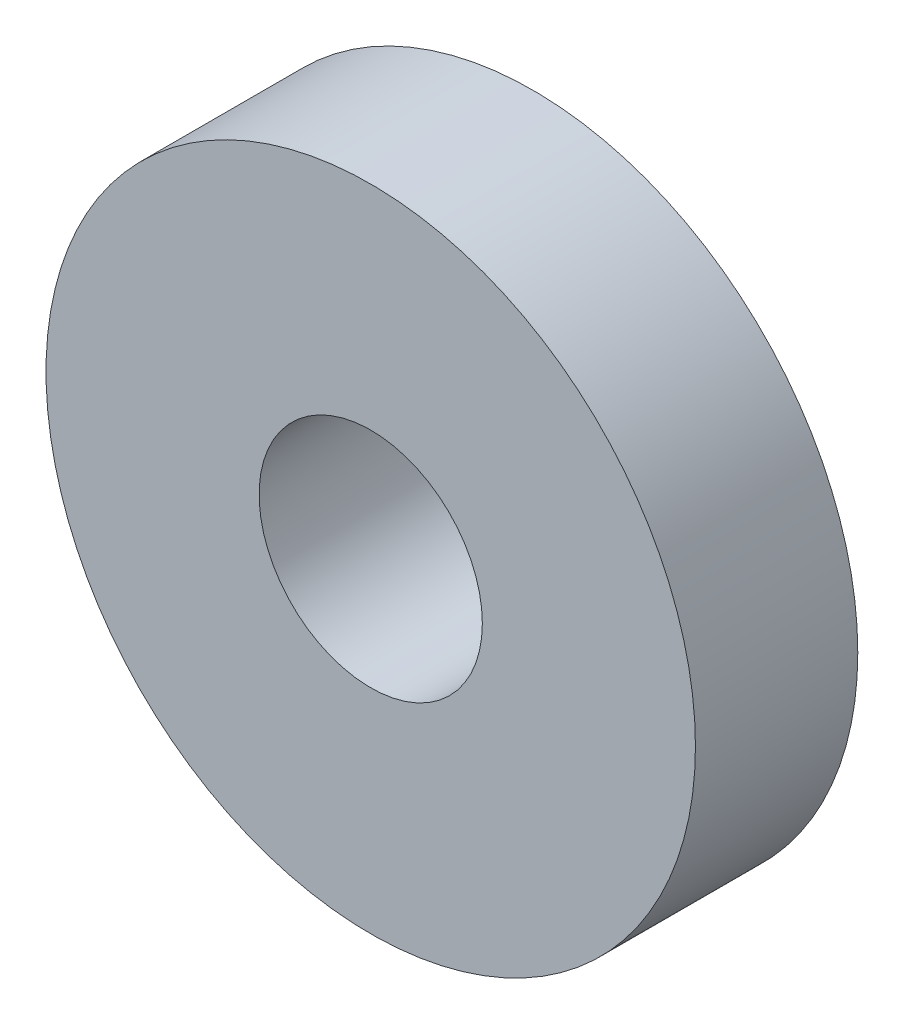
ISO-10303-21;
HEADER;
FILE_DESCRIPTION(('STEP AP214'),'2;1');
FILE_NAME('part.step','',(''),(''),'','','');
FILE_SCHEMA(('AUTOMOTIVE_DESIGN { 1 0 10303 214 1 1 1 1 }'));
ENDSEC;
DATA;
#1=APPLICATION_CONTEXT('core data for automotive mechanical design processes');
#2=APPLICATION_PROTOCOL_DEFINITION('international standard','automotive_design',2000,#1);
#3=PRODUCT_CONTEXT('',#1,'mechanical');
#4=PRODUCT('Part','Part','',(#3));
#5=PRODUCT_RELATED_PRODUCT_CATEGORY('part','',(#4));
#6=PRODUCT_DEFINITION_FORMATION('','',#4);
#7=PRODUCT_DEFINITION_CONTEXT('part definition',#1,'design');
#8=PRODUCT_DEFINITION('design','',#6,#7);
#9=PRODUCT_DEFINITION_SHAPE('','',#8);
#10=(LENGTH_UNIT() NAMED_UNIT(*) SI_UNIT(.MILLI.,.METRE.));
#11=(NAMED_UNIT(*) PLANE_ANGLE_UNIT() SI_UNIT($,.RADIAN.));
#12=(NAMED_UNIT(*) SI_UNIT($,.STERADIAN.) SOLID_ANGLE_UNIT());
#13=UNCERTAINTY_MEASURE_WITH_UNIT(LENGTH_MEASURE(1.E-05),#10,'distance_accuracy_value','');
#14=(GEOMETRIC_REPRESENTATION_CONTEXT(3) GLOBAL_UNCERTAINTY_ASSIGNED_CONTEXT((#13)) GLOBAL_UNIT_ASSIGNED_CONTEXT((#10,
#11,#12)) REPRESENTATION_CONTEXT('',''));
#15=CARTESIAN_POINT('',(0.,0.,0.));
#16=DIRECTION('',(0.,0.,1.));
#17=DIRECTION('',(1.,0.,0.));
#18=AXIS2_PLACEMENT_3D('',#15,#16,#17);
#19=CARTESIAN_POINT('',(0.,0.,1.6));
#20=DIRECTION('',(0.,0.,1.));
#21=DIRECTION('',(1.,0.,0.));
#22=AXIS2_PLACEMENT_3D('',#19,#20,#21);
#23=PLANE('',#22);
#24=CARTESIAN_POINT('',(0.,0.,1.6));
#25=DIRECTION('',(0.,0.,1.));
#26=DIRECTION('',(1.,0.,0.));
#27=AXIS2_PLACEMENT_3D('',#24,#25,#26);
#28=CIRCLE('',#27,3.19999999999998);
#29=CARTESIAN_POINT('',(3.19999999999998,0.,1.6));
#30=VERTEX_POINT('',#29);
#31=EDGE_CURVE('E10',#30,#30,#28,.T.);
#32=ORIENTED_EDGE('',*,*,#31,.T.);
#33=EDGE_LOOP('',(#32));
#34=FACE_BOUND('',#33,.T.);
#35=CARTESIAN_POINT('',(0.,0.,1.6));
#36=DIRECTION('',(0.,0.,1.));
#37=DIRECTION('',(1.,0.,0.));
#38=AXIS2_PLACEMENT_3D('',#35,#36,#37);
#39=CIRCLE('',#38,1.09999999999999);
#40=CARTESIAN_POINT('',(1.09999999999999,0.,1.6));
#41=VERTEX_POINT('',#40);
#42=EDGE_CURVE('E43',#41,#41,#39,.T.);
#43=ORIENTED_EDGE('',*,*,#42,.F.);
#44=EDGE_LOOP('',(#43));
#45=FACE_BOUND('',#44,.T.);
#46=ADVANCED_FACE('F32',(#34,#45),#23,.T.);
#47=CARTESIAN_POINT('',(0.,0.,0.));
#48=DIRECTION('',(0.,0.,1.));
#49=DIRECTION('',(1.,0.,0.));
#50=AXIS2_PLACEMENT_3D('',#47,#48,#49);
#51=PLANE('',#50);
#52=CARTESIAN_POINT('',(0.,0.,0.));
#53=DIRECTION('',(0.,0.,1.));
#54=DIRECTION('',(1.,0.,0.));
#55=AXIS2_PLACEMENT_3D('',#52,#53,#54);
#56=CIRCLE('',#55,3.19999999999998);
#57=CARTESIAN_POINT('',(3.19999999999998,0.,0.));
#58=VERTEX_POINT('',#57);
#59=EDGE_CURVE('E36',#58,#58,#56,.T.);
#60=ORIENTED_EDGE('',*,*,#59,.F.);
#61=EDGE_LOOP('',(#60));
#62=FACE_BOUND('',#61,.T.);
#63=CARTESIAN_POINT('',(0.,0.,0.));
#64=DIRECTION('',(0.,0.,1.));
#65=DIRECTION('',(1.,0.,0.));
#66=AXIS2_PLACEMENT_3D('',#63,#64,#65);
#67=CIRCLE('',#66,1.09999999999999);
#68=CARTESIAN_POINT('',(1.09999999999999,0.,0.));
#69=VERTEX_POINT('',#68);
#70=EDGE_CURVE('E45',#69,#69,#67,.T.);
#71=ORIENTED_EDGE('',*,*,#70,.T.);
#72=EDGE_LOOP('',(#71));
#73=FACE_BOUND('',#72,.T.);
#74=ADVANCED_FACE('F55',(#62,#73),#51,.F.);
#75=CARTESIAN_POINT('',(0.,0.,1.6));
#76=DIRECTION('',(0.,0.,-1.));
#77=DIRECTION('',(-1.,0.,0.));
#78=AXIS2_PLACEMENT_3D('',#75,#76,#77);
#79=CYLINDRICAL_SURFACE('',#78,3.19999999999998);
#80=ORIENTED_EDGE('',*,*,#31,.F.);
#81=EDGE_LOOP('',(#80));
#82=FACE_BOUND('',#81,.T.);
#83=ORIENTED_EDGE('',*,*,#59,.T.);
#84=EDGE_LOOP('',(#83));
#85=FACE_BOUND('',#84,.T.);
#86=ADVANCED_FACE('F34',(#82,#85),#79,.T.);
#87=CARTESIAN_POINT('',(0.,0.,1.6));
#88=DIRECTION('',(0.,0.,-1.));
#89=DIRECTION('',(-1.,0.,0.));
#90=AXIS2_PLACEMENT_3D('',#87,#88,#89);
#91=CYLINDRICAL_SURFACE('',#90,1.09999999999999);
#92=ORIENTED_EDGE('',*,*,#42,.T.);
#93=EDGE_LOOP('',(#92));
#94=FACE_BOUND('',#93,.T.);
#95=ORIENTED_EDGE('',*,*,#70,.F.);
#96=EDGE_LOOP('',(#95));
#97=FACE_BOUND('',#96,.T.);
#98=ADVANCED_FACE('F51',(#94,#97),#91,.F.);
#99=CLOSED_SHELL('',(#46,#74,#86,#98));
#100=MANIFOLD_SOLID_BREP('B2',#99);
#101=ADVANCED_BREP_SHAPE_REPRESENTATION('',(#18,#100),#14);
#102=SHAPE_DEFINITION_REPRESENTATION(#9,#101);
ENDSEC;
END-ISO-10303-21;
